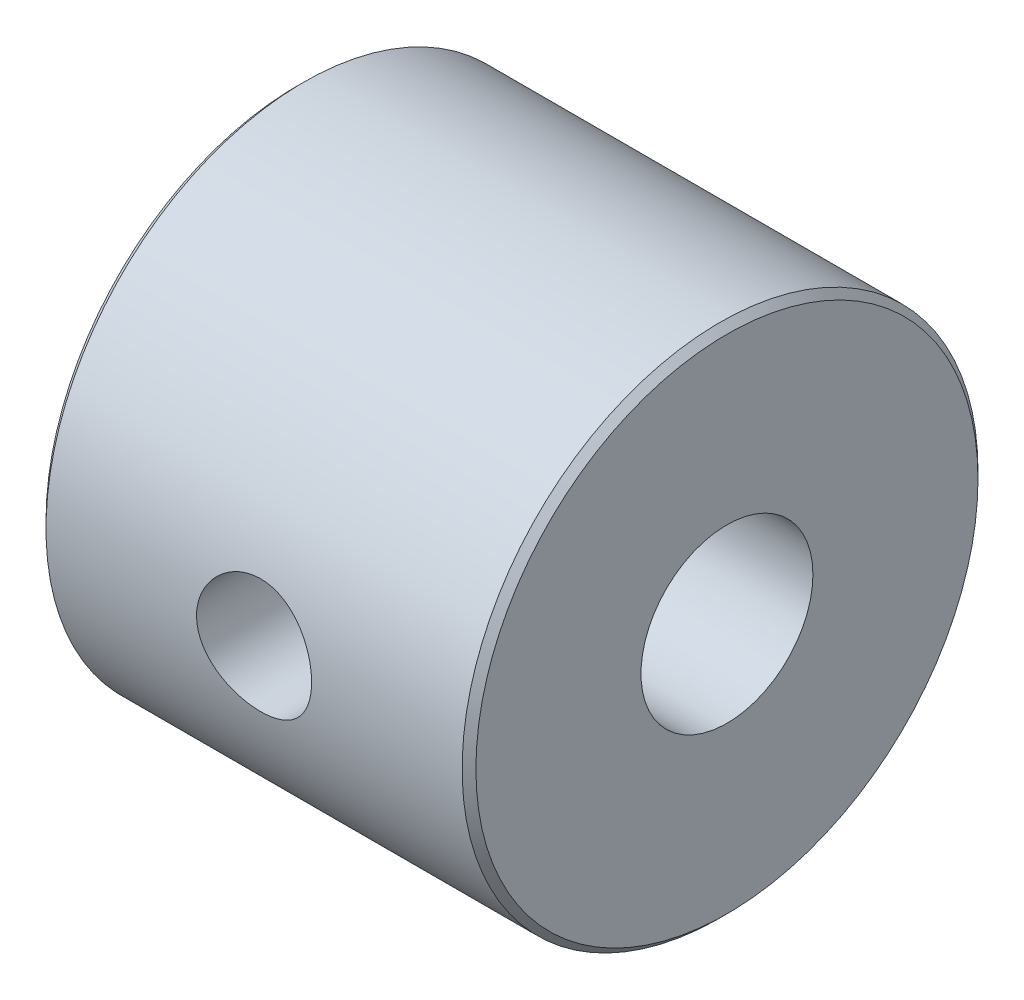
ISO-10303-21;
HEADER;
FILE_DESCRIPTION(('STEP AP214'),'2;1');
FILE_NAME('part.step','',(''),(''),'','','');
FILE_SCHEMA(('AUTOMOTIVE_DESIGN { 1 0 10303 214 1 1 1 1 }'));
ENDSEC;
DATA;
#1=APPLICATION_CONTEXT('core data for automotive mechanical design processes');
#2=APPLICATION_PROTOCOL_DEFINITION('international standard','automotive_design',2000,#1);
#3=PRODUCT_CONTEXT('',#1,'mechanical');
#4=PRODUCT('Part','Part','',(#3));
#5=PRODUCT_RELATED_PRODUCT_CATEGORY('part','',(#4));
#6=PRODUCT_DEFINITION_FORMATION('','',#4);
#7=PRODUCT_DEFINITION_CONTEXT('part definition',#1,'design');
#8=PRODUCT_DEFINITION('design','',#6,#7);
#9=PRODUCT_DEFINITION_SHAPE('','',#8);
#10=(LENGTH_UNIT() NAMED_UNIT(*) SI_UNIT(.MILLI.,.METRE.));
#11=(NAMED_UNIT(*) PLANE_ANGLE_UNIT() SI_UNIT($,.RADIAN.));
#12=(NAMED_UNIT(*) SI_UNIT($,.STERADIAN.) SOLID_ANGLE_UNIT());
#13=UNCERTAINTY_MEASURE_WITH_UNIT(LENGTH_MEASURE(1.E-05),#10,'distance_accuracy_value','');
#14=(GEOMETRIC_REPRESENTATION_CONTEXT(3) GLOBAL_UNCERTAINTY_ASSIGNED_CONTEXT((#13)) GLOBAL_UNIT_ASSIGNED_CONTEXT((#10,
#11,#12)) REPRESENTATION_CONTEXT('',''));
#15=CARTESIAN_POINT('',(0.,0.,0.));
#16=DIRECTION('',(0.,0.,1.));
#17=DIRECTION('',(1.,0.,0.));
#18=AXIS2_PLACEMENT_3D('',#15,#16,#17);
#19=CARTESIAN_POINT('',(31.75,0.,0.));
#20=DIRECTION('',(-1.,0.,0.));
#21=DIRECTION('',(0.,0.,1.));
#22=AXIS2_PLACEMENT_3D('',#19,#20,#21);
#23=CYLINDRICAL_SURFACE('',#22,19.05);
#24=CARTESIAN_POINT('',(31.242,0.,0.));
#25=DIRECTION('',(1.,0.,0.));
#26=DIRECTION('',(0.,0.,-1.));
#27=AXIS2_PLACEMENT_3D('',#24,#25,#26);
#28=CIRCLE('',#27,19.05);
#29=CARTESIAN_POINT('',(31.242,0.,-19.05));
#30=VERTEX_POINT('',#29);
#31=EDGE_CURVE('E38',#30,#30,#28,.F.);
#32=ORIENTED_EDGE('',*,*,#31,.T.);
#33=EDGE_LOOP('',(#32));
#34=FACE_BOUND('',#33,.T.);
#35=CARTESIAN_POINT('',(0.508000000000002,0.,0.));
#36=DIRECTION('',(1.,0.,0.));
#37=DIRECTION('',(0.,0.,-1.));
#38=AXIS2_PLACEMENT_3D('',#35,#36,#37);
#39=CIRCLE('',#38,19.05);
#40=CARTESIAN_POINT('',(0.508000000000002,0.,-19.05));
#41=VERTEX_POINT('',#40);
#42=EDGE_CURVE('E42',#41,#41,#39,.T.);
#43=ORIENTED_EDGE('',*,*,#42,.T.);
#44=EDGE_LOOP('',(#43));
#45=FACE_BOUND('',#44,.T.);
#46=CARTESIAN_POINT('',(18.375,0.,-19.05));
#47=CARTESIAN_POINT('',(18.3749940986378,0.139781689040155,-19.0499979719399));
#48=CARTESIAN_POINT('',(18.3632371077216,0.27964927887069,-19.0484452828352));
#49=CARTESIAN_POINT('',(18.316524062184,0.555488355699099,-19.0424006678495));
#50=CARTESIAN_POINT('',(18.28154416393,0.691455688353974,-19.037905721134));
#51=CARTESIAN_POINT('',(18.1894371364801,0.955461303983656,-19.0264826809257));
#52=CARTESIAN_POINT('',(18.1323253439302,1.08350500666245,-19.0195562726648));
#53=CARTESIAN_POINT('',(17.9976102237656,1.32816752955174,-19.0040395011631));
#54=CARTESIAN_POINT('',(17.9200102543922,1.44478821783099,-18.9954494106798));
#55=CARTESIAN_POINT('',(17.7460206019274,1.66402230818858,-18.9775054082484));
#56=CARTESIAN_POINT('',(17.6495317561643,1.76655670340078,-18.9681476236082));
#57=CARTESIAN_POINT('',(17.4407163859627,1.95402689989863,-18.9497539226443));
#58=CARTESIAN_POINT('',(17.3283890318649,2.03896177870326,-18.940718023213));
#59=CARTESIAN_POINT('',(17.090567473734,2.18911951571436,-18.9239532259491));
#60=CARTESIAN_POINT('',(16.9650257765547,2.25426775946921,-18.9162293226606));
#61=CARTESIAN_POINT('',(16.7046649038769,2.36252633293306,-18.9030146191876));
#62=CARTESIAN_POINT('',(16.5698461158078,2.4056375823169,-18.8975237258144));
#63=CARTESIAN_POINT('',(16.2955809026825,2.46835700397864,-18.8894340332593));
#64=CARTESIAN_POINT('',(16.1561655887991,2.48809906044446,-18.8868187655614));
#65=CARTESIAN_POINT('',(15.875978074941,2.50393408779853,-18.8847261471262));
#66=CARTESIAN_POINT('',(15.7352059352049,2.5000281037995,-18.8852486577162));
#67=CARTESIAN_POINT('',(15.4572367716533,2.4687877134451,-18.8893574882128));
#68=CARTESIAN_POINT('',(15.3200228040394,2.44160116305862,-18.8929244720583));
#69=CARTESIAN_POINT('',(15.0521214795487,2.36480223499386,-18.9026901731022));
#70=CARTESIAN_POINT('',(14.921434267291,2.31518936064043,-18.9088889485864));
#71=CARTESIAN_POINT('',(14.6698390600702,2.19478839281525,-18.9232415833332));
#72=CARTESIAN_POINT('',(14.548961980565,2.12393642687668,-18.9314013249336));
#73=CARTESIAN_POINT('',(14.3207571976609,1.96311414632755,-18.9487520224993));
#74=CARTESIAN_POINT('',(14.2134301773892,1.87314286842861,-18.9579430304119));
#75=CARTESIAN_POINT('',(14.014514222326,1.67581831246169,-18.9764065059943));
#76=CARTESIAN_POINT('',(13.9230515998653,1.56833766371212,-18.9856790601894));
#77=CARTESIAN_POINT('',(13.7594455055069,1.33948286070071,-19.0031953612218));
#78=CARTESIAN_POINT('',(13.6873020862709,1.21810866856812,-19.0114391052547));
#79=CARTESIAN_POINT('',(13.5643807098341,0.964811928950426,-19.0259748138382));
#80=CARTESIAN_POINT('',(13.5136110884205,0.832885289833144,-19.0322660166462));
#81=CARTESIAN_POINT('',(13.4349809541242,0.562278365918328,-19.0421810361741));
#82=CARTESIAN_POINT('',(13.4071192583521,0.423598430230412,-19.0458049906207));
#83=CARTESIAN_POINT('',(13.375260564846,0.144513215886066,-19.0499592130436));
#84=CARTESIAN_POINT('',(13.3710896477447,0.00412811338562915,-19.0505120263026));
#85=CARTESIAN_POINT('',(13.3862713139097,-0.275339161875183,-19.0485226670755));
#86=CARTESIAN_POINT('',(13.405623343743,-0.414421365211761,-19.0459805674045));
#87=CARTESIAN_POINT('',(13.4671570482528,-0.686818455369707,-19.0381010286319));
#88=CARTESIAN_POINT('',(13.5092553747015,-0.820152490765829,-19.0327737972571));
#89=CARTESIAN_POINT('',(13.6149997131701,-1.07786858605537,-19.0199201415042));
#90=CARTESIAN_POINT('',(13.6786465242341,-1.2022503137789,-19.0123936355758));
#91=CARTESIAN_POINT('',(13.826098941591,-1.43930501622495,-18.9959236924494));
#92=CARTESIAN_POINT('',(13.910016544571,-1.55190777736,-18.9869724808617));
#93=CARTESIAN_POINT('',(14.0954705801481,-1.76149279108896,-18.9686776477334));
#94=CARTESIAN_POINT('',(14.1970077865691,-1.85847435726501,-18.9593340089716));
#95=CARTESIAN_POINT('',(14.4155868153536,-2.03468478726578,-18.9412373912647));
#96=CARTESIAN_POINT('',(14.5327222165357,-2.11379805356646,-18.9324885008275));
#97=CARTESIAN_POINT('',(14.7787205531304,-2.25122641766461,-18.9166404374497));
#98=CARTESIAN_POINT('',(14.9075832333968,-2.30954196781502,-18.9095412286295));
#99=CARTESIAN_POINT('',(15.1730118077069,-2.40353423040343,-18.8978246235153));
#100=CARTESIAN_POINT('',(15.3095546581268,-2.43927510293925,-18.893200199343));
#101=CARTESIAN_POINT('',(15.5867688386097,-2.48730955867046,-18.8869369578119));
#102=CARTESIAN_POINT('',(15.7274399549183,-2.49960435369531,-18.8852979861478));
#103=CARTESIAN_POINT('',(16.0077670435217,-2.50037387693662,-18.8851960233401));
#104=CARTESIAN_POINT('',(16.1474225430022,-2.48903023874708,-18.8867088145816));
#105=CARTESIAN_POINT('',(16.4228231626314,-2.44323060009688,-18.8926877270721));
#106=CARTESIAN_POINT('',(16.5585682837408,-2.40877460531362,-18.8971538475957));
#107=CARTESIAN_POINT('',(16.822264729803,-2.31778690220757,-18.9085284809878));
#108=CARTESIAN_POINT('',(16.9502194440744,-2.26126487448977,-18.9154359226969));
#109=CARTESIAN_POINT('',(17.194857930642,-2.12776740713926,-18.930916552256));
#110=CARTESIAN_POINT('',(17.3115415048805,-2.05079160817995,-18.9394897693692));
#111=CARTESIAN_POINT('',(17.5312527928675,-1.8779008571677,-18.9574147956252));
#112=CARTESIAN_POINT('',(17.6341736833042,-1.78185068793612,-18.9667718706057));
#113=CARTESIAN_POINT('',(17.8225048291617,-1.57382128727449,-18.9851643854559));
#114=CARTESIAN_POINT('',(17.9079109659358,-1.46183831966128,-18.9941997492624));
#115=CARTESIAN_POINT('',(18.0590968227979,-1.22458043168706,-19.0109729834733));
#116=CARTESIAN_POINT('',(18.1247929045609,-1.09925184218548,-19.0187052652188));
#117=CARTESIAN_POINT('',(18.2341105288687,-0.839306696881373,-19.031945070151));
#118=CARTESIAN_POINT('',(18.2777557978644,-0.704700301956284,-19.0374549832904));
#119=CARTESIAN_POINT('',(18.331411488327,-0.474515037085983,-19.0443172737458));
#120=CARTESIAN_POINT('',(18.3477333478902,-0.380381125215548,-19.046437784803));
#121=CARTESIAN_POINT('',(18.3695295726849,-0.190844817719932,-19.0492798344051));
#122=CARTESIAN_POINT('',(18.3750040294288,-0.0954424328028588,-19.0500013847521));
#123=CARTESIAN_POINT('',(18.375,0.,-19.05));
#124=B_SPLINE_CURVE_WITH_KNOTS('',3,(#46,#47,#48,#49,#50,#51,#52,#53,#54,#55,#56,#57,#58,#59,
#60,#61,#62,#63,#64,#65,#66,#67,#68,#69,#70,#71,#72,#73,#74,#75,#76,#77,#78,#79,#80,#81,#82,#83,
#84,#85,#86,#87,#88,#89,#90,#91,#92,#93,#94,#95,#96,#97,#98,#99,#100,#101,#102,#103,#104,#105,
#106,#107,#108,#109,#110,#111,#112,#113,#114,#115,#116,#117,#118,#119,#120,#121,#122,#123),
.UNSPECIFIED.,.T.,.F.,(4,2,2,2,2,2,2,2,2,2,2,2,2,2,2,2,2,2,2,2,2,2,2,2,2,2,2,2,2,2,2,2,2,2,2,2,
2,2,4),(0.,0.418996415350858,0.838423693162188,1.25756084046036,1.6766293290993,
2.09795987791753,2.51931250525004,2.94223485027325,3.36513954394186,3.78560946846697,
4.20606081068031,4.62386148492033,5.04167141263338,5.46075064791518,5.87985100267621,
6.30214867085866,6.72444749015956,7.14691085388964,7.56935240163983,7.98868866189615,
8.40801505646649,8.82581525057175,9.2436309389142,9.6638101071185,10.0840077335685,
10.506850530028,10.9296841290426,11.3513105087945,11.7729150958553,12.1912920956066,
12.6096689925862,13.0278625490287,13.4460634526738,13.8673421919036,14.2887198827806,
14.7118611625296,15.134546171695,15.4206378255109,15.7067270657495),.UNSPECIFIED.);
#125=CARTESIAN_POINT('',(18.375,0.,-19.05));
#126=VERTEX_POINT('',#125);
#127=EDGE_CURVE('E59',#126,#126,#124,.T.);
#128=ORIENTED_EDGE('',*,*,#127,.T.);
#129=EDGE_LOOP('',(#128));
#130=FACE_BOUND('',#129,.T.);
#131=CARTESIAN_POINT('',(11.625,0.,19.05));
#132=CARTESIAN_POINT('',(11.6250078775895,-0.235596980444605,19.0499956748903));
#133=CARTESIAN_POINT('',(11.6446564461589,-0.471288134018262,19.045585154015));
#134=CARTESIAN_POINT('',(11.7226452362306,-0.935967708059661,19.0284168836046));
#135=CARTESIAN_POINT('',(11.7810123477362,-1.16495135468392,19.0156533329786));
#136=CARTESIAN_POINT('',(11.9345127671249,-1.60943387367071,18.9831991050863));
#137=CARTESIAN_POINT('',(12.0296068978138,-1.8249468317421,18.9635158112025));
#138=CARTESIAN_POINT('',(12.2537358032901,-2.23695281993615,18.9193427295638));
#139=CARTESIAN_POINT('',(12.3827699745116,-2.43344618820486,18.8948530272847));
#140=CARTESIAN_POINT('',(12.6733897559712,-2.8051141645124,18.843290734611));
#141=CARTESIAN_POINT('',(12.8354325867683,-2.97992669367173,18.8161850412217));
#142=CARTESIAN_POINT('',(13.1864886666675,-3.30013014320736,18.7626771842304));
#143=CARTESIAN_POINT('',(13.3755043960157,-3.44551835494517,18.7362750855916));
#144=CARTESIAN_POINT('',(13.7778356905257,-3.70435750986058,18.6868364741446));
#145=CARTESIAN_POINT('',(13.9914065760373,-3.81742040832303,18.6638423305168));
#146=CARTESIAN_POINT('',(14.4351151094985,-4.00590956669257,18.6242993257419));
#147=CARTESIAN_POINT('',(14.6652506863057,-4.08134052253393,18.6077496604716));
#148=CARTESIAN_POINT('',(15.1316207852718,-4.19122281806099,18.5833070008859));
#149=CARTESIAN_POINT('',(15.3676966856411,-4.22631658720661,18.5752784582765));
#150=CARTESIAN_POINT('',(15.842511296341,-4.25652636672152,18.5683801581588));
#151=CARTESIAN_POINT('',(16.0812496617453,-4.25164749687903,18.5695092277221));
#152=CARTESIAN_POINT('',(16.5498172398158,-4.20256689310267,18.5806759745756));
#153=CARTESIAN_POINT('',(16.7797295423077,-4.15911393953817,18.5905440068534));
#154=CARTESIAN_POINT('',(17.2289164374559,-4.03530601182196,18.6178083049889));
#155=CARTESIAN_POINT('',(17.4481904109233,-3.95494889255784,18.6352050084589));
#156=CARTESIAN_POINT('',(17.8719683372588,-3.75893277003606,18.6757321213875));
#157=CARTESIAN_POINT('',(18.0763355199346,-3.64298800812949,18.6989086478394));
#158=CARTESIAN_POINT('',(18.462989166743,-3.37928862058338,18.7483560180788));
#159=CARTESIAN_POINT('',(18.6452725005791,-3.23152949361027,18.7746272994968));
#160=CARTESIAN_POINT('',(18.9868925395679,-2.90444327246553,18.8280301736636));
#161=CARTESIAN_POINT('',(19.1456198827924,-2.72448007681627,18.8551678154862));
#162=CARTESIAN_POINT('',(19.4307427716325,-2.34017913287333,18.9067074968035));
#163=CARTESIAN_POINT('',(19.5571376847938,-2.1358409078947,18.9311094827808));
#164=CARTESIAN_POINT('',(19.7741678875936,-1.70783000207662,18.9745127111338));
#165=CARTESIAN_POINT('',(19.8647208123173,-1.48411421181882,18.9935014862761));
#166=CARTESIAN_POINT('',(20.0067780979173,-1.0241233082929,19.0238464561125));
#167=CARTESIAN_POINT('',(20.0582883716468,-0.787850102597398,19.0352038065257));
#168=CARTESIAN_POINT('',(20.1199060269274,-0.314675936425735,19.0488408918955));
#169=CARTESIAN_POINT('',(20.130845447751,-0.07788843618531,19.0513030250007));
#170=CARTESIAN_POINT('',(20.1132696175541,0.394130840678833,19.0473844949497));
#171=CARTESIAN_POINT('',(20.0847571564738,0.629362726129835,19.0410044570899));
#172=CARTESIAN_POINT('',(19.9897764190875,1.08881879719047,19.0202338073902));
#173=CARTESIAN_POINT('',(19.9237468721061,1.31313823927429,19.0059358369726));
#174=CARTESIAN_POINT('',(19.7560951341702,1.74751622632604,18.9709307301747));
#175=CARTESIAN_POINT('',(19.6544698280383,1.95757352121491,18.9502230328631));
#176=CARTESIAN_POINT('',(19.4167939142541,2.36088789885544,18.9042469958286));
#177=CARTESIAN_POINT('',(19.2802575123793,2.55385138211111,18.8789158753998));
#178=CARTESIAN_POINT('',(18.9772723243695,2.91442580798208,18.8266267490074));
#179=CARTESIAN_POINT('',(18.8108194854449,3.08203330994128,18.7996685229483));
#180=CARTESIAN_POINT('',(18.4489016392323,3.39044637005849,18.7465299239025));
#181=CARTESIAN_POINT('',(18.2529403665359,3.53067467250961,18.7203744711286));
#182=CARTESIAN_POINT('',(17.839761522143,3.77623577629903,18.6723930077702));
#183=CARTESIAN_POINT('',(17.6225448819204,3.8815701059095,18.6505668075918));
#184=CARTESIAN_POINT('',(17.1741958039019,4.05362826859852,18.6139287130227));
#185=CARTESIAN_POINT('',(16.9431512502322,4.12057219271947,18.5990769252978));
#186=CARTESIAN_POINT('',(16.4727168692664,4.21458727878124,18.5780009126678));
#187=CARTESIAN_POINT('',(16.2333284456482,4.24166511451448,18.5717752437154));
#188=CARTESIAN_POINT('',(15.758828575099,4.25488649348683,18.568749945406));
#189=CARTESIAN_POINT('',(15.5237435408445,4.24194616850769,18.5717393511823));
#190=CARTESIAN_POINT('',(15.0591949448321,4.17755306967668,18.5863288518167));
#191=CARTESIAN_POINT('',(14.8297313112493,4.12610078815942,18.5979288365975));
#192=CARTESIAN_POINT('',(14.3837023706338,3.98659494105887,18.6283276021893));
#193=CARTESIAN_POINT('',(14.1670917800101,3.89867982286733,18.6470991319999));
#194=CARTESIAN_POINT('',(13.7515605741334,3.68886096581474,18.6897355601408));
#195=CARTESIAN_POINT('',(13.5526418900234,3.56695352254511,18.7136010135291));
#196=CARTESIAN_POINT('',(13.1736364405692,3.28959403067173,18.7643626708187));
#197=CARTESIAN_POINT('',(12.9940328734151,3.13349130156564,18.7913119961706));
#198=CARTESIAN_POINT('',(12.6632700904681,2.79348455708471,18.8448535516644));
#199=CARTESIAN_POINT('',(12.5121174754925,2.60957410793037,18.8714456976124));
#200=CARTESIAN_POINT('',(12.2405713806368,2.21615353627842,18.9217065752127));
#201=CARTESIAN_POINT('',(12.1206247523042,2.00632893761288,18.9453305703215));
#202=CARTESIAN_POINT('',(11.9178933752718,1.56900985210211,18.9865419494512));
#203=CARTESIAN_POINT('',(11.8350780463722,1.34153008732898,19.0041342981307));
#204=CARTESIAN_POINT('',(11.7233991533403,0.928249621575709,19.0282311419841));
#205=CARTESIAN_POINT('',(11.6865710603558,0.744653044900812,19.0363431931296));
#206=CARTESIAN_POINT('',(11.6373689406188,0.374057325654092,19.04722921162));
#207=CARTESIAN_POINT('',(11.624993745383,0.187058346097254,19.0500034340333));
#208=CARTESIAN_POINT('',(11.625,0.,19.05));
#209=B_SPLINE_CURVE_WITH_KNOTS('',3,(#131,#132,#133,#134,#135,#136,#137,#138,#139,#140,#141,
#142,#143,#144,#145,#146,#147,#148,#149,#150,#151,#152,#153,#154,#155,#156,#157,#158,#159,#160,
#161,#162,#163,#164,#165,#166,#167,#168,#169,#170,#171,#172,#173,#174,#175,#176,#177,#178,#179,
#180,#181,#182,#183,#184,#185,#186,#187,#188,#189,#190,#191,#192,#193,#194,#195,#196,#197,#198,
#199,#200,#201,#202,#203,#204,#205,#206,#207,#208),.UNSPECIFIED.,.T.,.F.,(4,2,2,2,2,2,2,2,2,2,2,
2,2,2,2,2,2,2,2,2,2,2,2,2,2,2,2,2,2,2,2,2,2,2,2,2,2,2,4),(0.,0.706106131412663,1.4127031672095,
2.11854853921231,2.82438135980452,3.54075201658181,4.25718858847996,4.98189541757167,
5.70651179086563,6.41942029393282,7.13223748745485,7.83151323493795,8.53082963406458,
9.23591513439775,9.94110046111684,10.6621701551424,11.3832539529231,12.1059853128531,
12.8286071961301,13.5363246975007,14.2439921533857,14.9435495368666,15.6431681576994,
16.3531090668274,17.0631462244787,17.7868347114266,18.5104914983663,19.2299570059965,
19.9493020576247,20.6523021005479,21.3552931565128,22.0556390816513,22.7560613587923,
23.4711926262909,24.1864896052251,24.9115263171463,25.6359648092902,26.1966229166736,
26.7572542323293),.UNSPECIFIED.);
#210=CARTESIAN_POINT('',(11.625,0.,19.05));
#211=VERTEX_POINT('',#210);
#212=EDGE_CURVE('E82',#211,#211,#209,.T.);
#213=ORIENTED_EDGE('',*,*,#212,.F.);
#214=EDGE_LOOP('',(#213));
#215=FACE_BOUND('',#214,.T.);
#216=ADVANCED_FACE('F31',(#34,#45,#130,#215),#23,.T.);
#217=CARTESIAN_POINT('',(31.75,0.,0.));
#218=DIRECTION('',(-1.,0.,0.));
#219=DIRECTION('',(0.,0.,1.));
#220=AXIS2_PLACEMENT_3D('',#217,#218,#219);
#221=CYLINDRICAL_SURFACE('',#220,6.35);
#222=CARTESIAN_POINT('',(18.375,0.,-6.35));
#223=CARTESIAN_POINT('',(18.3749950049564,0.134553966169355,-6.34999617459859));
#224=CARTESIAN_POINT('',(18.3640751557637,0.269336571174968,-6.34567466237185));
#225=CARTESIAN_POINT('',(18.3207905952238,0.535088905639055,-6.32882335712604));
#226=CARTESIAN_POINT('',(18.2883711213123,0.66604800444862,-6.3162726039992));
#227=CARTESIAN_POINT('',(18.203434670697,0.919914813168561,-6.28431159303747));
#228=CARTESIAN_POINT('',(18.1509811437113,1.04284652175185,-6.26492300596665));
#229=CARTESIAN_POINT('',(18.0277180152143,1.27806359095826,-6.22120434546761));
#230=CARTESIAN_POINT('',(17.9569140186473,1.39035218812232,-6.19687578139019));
#231=CARTESIAN_POINT('',(17.795524683543,1.60639851936583,-6.14449798213655));
#232=CARTESIAN_POINT('',(17.7042361026491,1.70960334693637,-6.11633571933088));
#233=CARTESIAN_POINT('',(17.5059538296745,1.89970207687357,-6.05999026085159));
#234=CARTESIAN_POINT('',(17.3989529399151,1.98658846210173,-6.03180706150566));
#235=CARTESIAN_POINT('',(17.1667151987723,2.14524488686994,-5.97727145355802));
#236=CARTESIAN_POINT('',(17.0408937121066,2.2162084253797,-5.95104909754738));
#237=CARTESIAN_POINT('',(16.777911943275,2.33571898850402,-5.90517107596173));
#238=CARTESIAN_POINT('',(16.6407568739592,2.38427625190023,-5.88551241217646));
#239=CARTESIAN_POINT('',(16.3653508494304,2.45537613995342,-5.8561981222935));
#240=CARTESIAN_POINT('',(16.2274172333414,2.47897530665883,-5.84613817491155));
#241=CARTESIAN_POINT('',(15.949209226471,2.50279043279639,-5.83598535211524));
#242=CARTESIAN_POINT('',(15.8089359703588,2.50301741528153,-5.83588777813421));
#243=CARTESIAN_POINT('',(15.5400547077634,2.48088430587097,-5.84532483029983));
#244=CARTESIAN_POINT('',(15.4112951322367,2.46003752778908,-5.85421411113578));
#245=CARTESIAN_POINT('',(15.1592758587167,2.39886638306082,-5.87954286720676));
#246=CARTESIAN_POINT('',(15.0360170916798,2.35853873302629,-5.89598361517486));
#247=CARTESIAN_POINT('',(14.7955810024347,2.25879178559437,-5.93491910985821));
#248=CARTESIAN_POINT('',(14.6785751860298,2.19900587681632,-5.95752864103769));
#249=CARTESIAN_POINT('',(14.4558363361866,2.0622963800787,-6.00622089947436));
#250=CARTESIAN_POINT('',(14.3501074730521,1.9853664844086,-6.03230490365427));
#251=CARTESIAN_POINT('',(14.1446155241556,1.80979694623541,-6.0873805687355));
#252=CARTESIAN_POINT('',(14.0458875988427,1.70996507725302,-6.11644390139133));
#253=CARTESIAN_POINT('',(13.8662495741734,1.49484520138701,-6.17254267496692));
#254=CARTESIAN_POINT('',(13.7853428057571,1.3795543115359,-6.19957773616227));
#255=CARTESIAN_POINT('',(13.64234229979,1.13392939532751,-6.24921353521059));
#256=CARTESIAN_POINT('',(13.5806264607627,1.00335545974232,-6.27172244517836));
#257=CARTESIAN_POINT('',(13.4803899460577,0.732568757301266,-6.30907908571734));
#258=CARTESIAN_POINT('',(13.4418578689403,0.592360766197814,-6.32393058157942));
#259=CARTESIAN_POINT('',(13.3911494695432,0.314971963627265,-6.34361908161966));
#260=CARTESIAN_POINT('',(13.37758130377,0.178082917418505,-6.348984250052));
#261=CARTESIAN_POINT('',(13.3730907416084,-0.0961072640949436,-6.35075118028059));
#262=CARTESIAN_POINT('',(13.382162700082,-0.233408288149805,-6.34715517647539));
#263=CARTESIAN_POINT('',(13.4216622025234,-0.498292224086756,-6.33175038685379));
#264=CARTESIAN_POINT('',(13.4511495639312,-0.626038654697896,-6.32030337018418));
#265=CARTESIAN_POINT('',(13.5293742319494,-0.874660095981651,-6.29071971537707));
#266=CARTESIAN_POINT('',(13.5781140222739,-0.995534217770083,-6.2725822141346));
#267=CARTESIAN_POINT('',(13.6950444521159,-1.23110128938448,-6.23070166506756));
#268=CARTESIAN_POINT('',(13.7637803030612,-1.34549548641504,-6.20680525763775));
#269=CARTESIAN_POINT('',(13.9181441471455,-1.56152383451872,-6.15601152025899));
#270=CARTESIAN_POINT('',(14.003778787948,-1.66315293821617,-6.12911301115501));
#271=CARTESIAN_POINT('',(14.1959406850939,-1.85758269622987,-6.07311877997172));
#272=CARTESIAN_POINT('',(14.3034541282674,-1.9494024550278,-6.04399258985355));
#273=CARTESIAN_POINT('',(14.532894500357,-2.1139256988637,-5.98843710342074));
#274=CARTESIAN_POINT('',(14.6548234956553,-2.18662643847838,-5.9620081947592));
#275=CARTESIAN_POINT('',(14.9112445072933,-2.31119994331425,-5.91484149302209));
#276=CARTESIAN_POINT('',(15.0458308081313,-2.3628981425998,-5.89415183494788));
#277=CARTESIAN_POINT('',(15.3228548094581,-2.44251241444137,-5.86161395579081));
#278=CARTESIAN_POINT('',(15.4652868886552,-2.4704452841983,-5.84975949077937));
#279=CARTESIAN_POINT('',(15.743211889923,-2.5001560817428,-5.83711880455703));
#280=CARTESIAN_POINT('',(15.8784922692523,-2.50362861133498,-5.83561562798868));
#281=CARTESIAN_POINT('',(16.1476084404769,-2.48874240848286,-5.84197965531299));
#282=CARTESIAN_POINT('',(16.2814444006197,-2.47038624697604,-5.84984575571204));
#283=CARTESIAN_POINT('',(16.5387958562813,-2.4137318242914,-5.87343850874575));
#284=CARTESIAN_POINT('',(16.6625100297439,-2.37619878243832,-5.88886266755422));
#285=CARTESIAN_POINT('',(16.9019403587713,-2.28296099085997,-5.92562971284347));
#286=CARTESIAN_POINT('',(17.017654393116,-2.22725144389621,-5.94697416161505));
#287=CARTESIAN_POINT('',(17.2448650669459,-2.09562924514573,-5.99466372804074));
#288=CARTESIAN_POINT('',(17.3557615112271,-2.01875899704479,-6.02122212029708));
#289=CARTESIAN_POINT('',(17.5636202572178,-1.84841299459082,-6.07567751475916));
#290=CARTESIAN_POINT('',(17.6605776715191,-1.75493144142048,-6.10357498193042));
#291=CARTESIAN_POINT('',(17.8439681894365,-1.5471064695902,-6.15964587366995));
#292=CARTESIAN_POINT('',(17.9293735925985,-1.43182793668255,-6.1877288181631));
#293=CARTESIAN_POINT('',(18.0796111272694,-1.18753251019108,-6.23921573147771));
#294=CARTESIAN_POINT('',(18.144440520185,-1.05851379088707,-6.26261907730808));
#295=CARTESIAN_POINT('',(18.2466484853223,-0.801712000574561,-6.30040957078148));
#296=CARTESIAN_POINT('',(18.2858921084602,-0.674756215325959,-6.31539404397001));
#297=CARTESIAN_POINT('',(18.3437302524382,-0.415787686623074,-6.3376970595587));
#298=CARTESIAN_POINT('',(18.3623815268315,-0.283789884654928,-6.3450366684114));
#299=CARTESIAN_POINT('',(18.3719467777404,-0.126085882756387,-6.34879873710875));
#300=CARTESIAN_POINT('',(18.3730908694645,-0.100887023550413,-6.34924857226754));
#301=CARTESIAN_POINT('',(18.374617969314,-0.0504614577838966,-6.34984957040439));
#302=CARTESIAN_POINT('',(18.375000936789,-0.0252347498079839,-6.35000071742997));
#303=CARTESIAN_POINT('',(18.375,0.,-6.35));
#304=B_SPLINE_CURVE_WITH_KNOTS('',3,(#222,#223,#224,#225,#226,#227,#228,#229,#230,#231,#232,
#233,#234,#235,#236,#237,#238,#239,#240,#241,#242,#243,#244,#245,#246,#247,#248,#249,#250,#251,
#252,#253,#254,#255,#256,#257,#258,#259,#260,#261,#262,#263,#264,#265,#266,#267,#268,#269,#270,
#271,#272,#273,#274,#275,#276,#277,#278,#279,#280,#281,#282,#283,#284,#285,#286,#287,#288,#289,
#290,#291,#292,#293,#294,#295,#296,#297,#298,#299,#300,#301,#302,#303),.UNSPECIFIED.,.T.,.F.,(4,
2,2,2,2,2,2,2,2,2,2,2,2,2,2,2,2,2,2,2,2,2,2,2,2,2,2,2,2,2,2,2,2,2,2,2,2,2,2,2,4),(0.,
0.403558875489098,0.808149640616257,1.21146951410153,1.61466634295684,2.03471952872487,
2.45496574116262,2.89320518926667,3.33124418047491,3.74989041671428,4.16833920539152,
4.55873339731187,4.94919341088217,5.34748294469489,5.7459192620459,6.17411035489119,
6.60238141285147,7.0386180307487,7.47463993804278,7.88551530365009,8.29628823093428,
8.68930295059461,9.08236838880241,9.48735796439885,9.8925071739458,10.3235785470974,
10.7547117868103,11.1893585465848,11.623697844666,12.027621150145,12.4314968870954,
12.8203869038963,13.2093796417258,13.620181819931,14.0311276872341,14.4675975397313,
14.9041254604669,15.3035452259819,15.701861401018,15.7775422872301,15.853227215335),.UNSPECIFIED.);
#305=CARTESIAN_POINT('',(18.375,0.,-6.35));
#306=VERTEX_POINT('',#305);
#307=EDGE_CURVE('E52',#306,#306,#304,.T.);
#308=ORIENTED_EDGE('',*,*,#307,.F.);
#309=EDGE_LOOP('',(#308));
#310=FACE_BOUND('',#309,.T.);
#311=CARTESIAN_POINT('',(0.,0.,0.));
#312=DIRECTION('',(1.,0.,0.));
#313=DIRECTION('',(0.,0.,-1.));
#314=AXIS2_PLACEMENT_3D('',#311,#312,#313);
#315=CIRCLE('',#314,6.35);
#316=CARTESIAN_POINT('',(0.,0.,-6.35));
#317=VERTEX_POINT('',#316);
#318=EDGE_CURVE('E106',#317,#317,#315,.T.);
#319=ORIENTED_EDGE('',*,*,#318,.F.);
#320=EDGE_LOOP('',(#319));
#321=FACE_BOUND('',#320,.T.);
#322=CARTESIAN_POINT('',(31.75,0.,0.));
#323=DIRECTION('',(1.,0.,0.));
#324=DIRECTION('',(0.,0.,-1.));
#325=AXIS2_PLACEMENT_3D('',#322,#323,#324);
#326=CIRCLE('',#325,6.35);
#327=CARTESIAN_POINT('',(31.75,0.,-6.35));
#328=VERTEX_POINT('',#327);
#329=EDGE_CURVE('E51',#328,#328,#326,.T.);
#330=ORIENTED_EDGE('',*,*,#329,.T.);
#331=EDGE_LOOP('',(#330));
#332=FACE_BOUND('',#331,.T.);
#333=CARTESIAN_POINT('',(20.125,0.,6.35));
#334=CARTESIAN_POINT('',(20.1250000427101,0.106663462632682,6.35000004539256));
#335=CARTESIAN_POINT('',(20.1209790697073,0.213325881475982,6.34730669861905));
#336=CARTESIAN_POINT('',(20.1049571198466,0.425818635656144,6.33660020303112));
#337=CARTESIAN_POINT('',(20.0929530473953,0.531648632092113,6.32858499056743));
#338=CARTESIAN_POINT('',(20.0611429112683,0.741603551278382,6.30742818163162));
#339=CARTESIAN_POINT('',(20.0413373198844,0.845728576847548,6.29428689548436));
#340=CARTESIAN_POINT('',(19.9942130905437,1.05154694690419,6.26319476322004));
#341=CARTESIAN_POINT('',(19.9668912530932,1.15323923574859,6.24524186899564));
#342=CARTESIAN_POINT('',(19.8744759466453,1.45260605115246,6.18494897968906));
#343=CARTESIAN_POINT('',(19.7987410588871,1.64580002797676,6.13604386041241));
#344=CARTESIAN_POINT('',(19.622142344913,2.01583182722331,6.02464905566807));
#345=CARTESIAN_POINT('',(19.5212747619491,2.19266719899448,5.96215733950123));
#346=CARTESIAN_POINT('',(19.287923229114,2.54209973370208,5.82224821550171));
#347=CARTESIAN_POINT('',(19.1534785127023,2.71305392241933,5.74401298986289));
#348=CARTESIAN_POINT('',(18.861431410679,3.03158739457785,5.58246467299002));
#349=CARTESIAN_POINT('',(18.703795685573,3.17913237932083,5.49914437406296));
#350=CARTESIAN_POINT('',(18.4383118005877,3.39227521733549,5.36874326911306));
#351=CARTESIAN_POINT('',(18.3373561203395,3.46626580303488,5.32113807171357));
#352=CARTESIAN_POINT('',(18.1287029002193,3.60542333941211,5.2278530022502));
#353=CARTESIAN_POINT('',(18.021003820441,3.67058826385821,5.1821735739646));
#354=CARTESIAN_POINT('',(17.6884537151618,3.85193934489228,5.05047227613512));
#355=CARTESIAN_POINT('',(17.4536136155681,3.95441531620215,4.96950864734771));
#356=CARTESIAN_POINT('',(17.0336542836621,4.09313124224461,4.85535025852366));
#357=CARTESIAN_POINT('',(16.8539144680124,4.13996518148155,4.81511114028885));
#358=CARTESIAN_POINT('',(16.4867528453758,4.20987182032324,4.75412194707822));
#359=CARTESIAN_POINT('',(16.2993450352068,4.23298596684503,4.73333788280472));
#360=CARTESIAN_POINT('',(15.921140151073,4.25398311284153,4.71448494486316));
#361=CARTESIAN_POINT('',(15.7303321805042,4.25176018721054,4.71651143340077));
#362=CARTESIAN_POINT('',(15.3522391134377,4.22199571023032,4.74316408496659));
#363=CARTESIAN_POINT('',(15.1649571399309,4.19443270092747,4.76780940156197));
#364=CARTESIAN_POINT('',(14.8074968498533,4.11763061318343,4.83425369253599));
#365=CARTESIAN_POINT('',(14.636928032457,4.06943908303621,4.87521776502949));
#366=CARTESIAN_POINT('',(14.3061772179,3.95373621649045,4.96950966155582));
#367=CARTESIAN_POINT('',(14.1459986670865,3.88621850958065,5.02284156130846));
#368=CARTESIAN_POINT('',(13.8057188511111,3.71801014421801,5.14898583360738));
#369=CARTESIAN_POINT('',(13.6282307954693,3.61336060786915,5.22355218488158));
#370=CARTESIAN_POINT('',(13.2912648253418,3.38065308755118,5.37709744366563));
#371=CARTESIAN_POINT('',(13.1318095667108,3.25256617481629,5.45608171963362));
#372=CARTESIAN_POINT('',(12.7995927633904,2.94387782043362,5.62973294892286));
#373=CARTESIAN_POINT('',(12.6315659396761,2.75791894728697,5.72404585433874));
#374=CARTESIAN_POINT('',(12.3287600383482,2.35582008534264,5.90091320869186));
#375=CARTESIAN_POINT('',(12.1939504151171,2.13970811315303,5.98347843072157));
#376=CARTESIAN_POINT('',(11.9857946651095,1.72601321705397,6.11397737697846));
#377=CARTESIAN_POINT('',(11.9055854381107,1.53306353347,6.16552574627689));
#378=CARTESIAN_POINT('',(11.8067105869517,1.23393218913514,6.22979687089591));
#379=CARTESIAN_POINT('',(11.7773228308529,1.13258893017696,6.24904713854333));
#380=CARTESIAN_POINT('',(11.726041412153,0.927265119269704,6.28279236380054));
#381=CARTESIAN_POINT('',(11.7041447253863,0.823285649818614,6.29728924026909));
#382=CARTESIAN_POINT('',(11.6680636933641,0.612892794589259,6.3212444218768));
#383=CARTESIAN_POINT('',(11.653917643808,0.506469982830315,6.33067770335297));
#384=CARTESIAN_POINT('',(11.6337215551311,0.29256047738086,6.34416155904908));
#385=CARTESIAN_POINT('',(11.6276681618269,0.185074243070463,6.34821436332405));
#386=CARTESIAN_POINT('',(11.6237441518864,-0.0301312246428598,6.35084043070247));
#387=CARTESIAN_POINT('',(11.625874801025,-0.137850491512378,6.34941284618843));
#388=CARTESIAN_POINT('',(11.6382865762112,-0.352601206788481,6.34111342861899));
#389=CARTESIAN_POINT('',(11.6485673387971,-0.459632685653036,6.33424183834409));
#390=CARTESIAN_POINT('',(11.6760848031533,-0.664455312355957,6.31591570767091));
#391=CARTESIAN_POINT('',(11.6927644737899,-0.762354773453151,6.30482868285691));
#392=CARTESIAN_POINT('',(11.732780288761,-0.956204218665943,6.27835672478814));
#393=CARTESIAN_POINT('',(11.7561186852867,-1.05215353139728,6.2629703373897));
#394=CARTESIAN_POINT('',(11.8357181609976,-1.33614048439891,6.21080986958256));
#395=CARTESIAN_POINT('',(11.901586679826,-1.52048536820467,6.16801868328955));
#396=CARTESIAN_POINT('',(12.0608084374538,-1.88588375029244,6.06663610741601));
#397=CARTESIAN_POINT('',(12.1555543235027,-2.0661009239481,6.00726127812026));
#398=CARTESIAN_POINT('',(12.3676691764243,-2.40868414927565,5.87828871265739));
#399=CARTESIAN_POINT('',(12.4850517380393,-2.57103938124657,5.80868483931538));
#400=CARTESIAN_POINT('',(12.7600510249251,-2.9004608225688,5.65226609096892));
#401=CARTESIAN_POINT('',(12.9210956880043,-3.06419904589063,5.56447145780922));
#402=CARTESIAN_POINT('',(13.2673884556173,-3.36382875706528,5.38863123374627));
#403=CARTESIAN_POINT('',(13.452654161532,-3.49969980764485,5.30058550633394));
#404=CARTESIAN_POINT('',(13.8300939393365,-3.73175829326563,5.13953643620767));
#405=CARTESIAN_POINT('',(14.0205896706147,-3.83022074994705,5.06589501872926));
#406=CARTESIAN_POINT('',(14.4187619570164,-3.99854722211938,4.93412457395826));
#407=CARTESIAN_POINT('',(14.6264068474848,-4.0684625885743,4.87596775888733));
#408=CARTESIAN_POINT('',(15.0155912918958,-4.16609877474135,4.79264906177947));
#409=CARTESIAN_POINT('',(15.1948727918867,-4.19922656350859,4.7633778719238));
#410=CARTESIAN_POINT('',(15.5582763375006,-4.24211743665072,4.72523168655778));
#411=CARTESIAN_POINT('',(15.7423926398113,-4.25190707866634,4.71633350803932));
#412=CARTESIAN_POINT('',(16.1102361222553,-4.24747333225607,4.72032546743952));
#413=CARTESIAN_POINT('',(16.2939628592709,-4.23323023829508,4.73323348526242));
#414=CARTESIAN_POINT('',(16.6557139910157,-4.1816836469015,4.77882329332473));
#415=CARTESIAN_POINT('',(16.8337304219083,-4.14434930086916,4.81153153429245));
#416=CARTESIAN_POINT('',(17.2255908718636,-4.0360697729692,4.90294174121269));
#417=CARTESIAN_POINT('',(17.4366238690596,-3.95888669986636,4.96620545311481));
#418=CARTESIAN_POINT('',(17.8400425764271,-3.77497548019868,5.10739249579016));
#419=CARTESIAN_POINT('',(18.0324014750299,-3.66820567713517,5.18533644560506));
#420=CARTESIAN_POINT('',(18.4001167477307,-3.42573818181708,5.34870214016754));
#421=CARTESIAN_POINT('',(18.575090876166,-3.28953993699588,5.43423590216333));
#422=CARTESIAN_POINT('',(18.9022864563284,-2.99115658971889,5.60400902709952));
#423=CARTESIAN_POINT('',(19.0545007977133,-2.82896339888202,5.68824797818696));
#424=CARTESIAN_POINT('',(19.2741004171056,-2.55443250538021,5.81460373124655));
#425=CARTESIAN_POINT('',(19.3500889520754,-2.45011408378217,5.85943632819875));
#426=CARTESIAN_POINT('',(19.4928730631134,-2.2338895309982,5.94522843435642));
#427=CARTESIAN_POINT('',(19.5596727283863,-2.1219868082674,5.9861896638307));
#428=CARTESIAN_POINT('',(19.6832547823582,-1.89124596942599,6.06304112800329));
#429=CARTESIAN_POINT('',(19.740045419988,-1.77241367284349,6.09893553361628));
#430=CARTESIAN_POINT('',(19.8428137917653,-1.52854324582043,6.16457470744704));
#431=CARTESIAN_POINT('',(19.8887950729674,-1.40350716748688,6.19432149259761));
#432=CARTESIAN_POINT('',(19.9609964459007,-1.17410886525535,6.24137643638005));
#433=CARTESIAN_POINT('',(19.9893321341798,-1.07067392022611,6.25998342978081));
#434=CARTESIAN_POINT('',(20.0382136578145,-0.86122557607372,6.29221814361507));
#435=CARTESIAN_POINT('',(20.0587609949895,-0.755212678254226,6.30584682399281));
#436=CARTESIAN_POINT('',(20.0917531289022,-0.541460936253718,6.32778438600725));
#437=CARTESIAN_POINT('',(20.1042034068368,-0.43372331032985,6.33609686631161));
#438=CARTESIAN_POINT('',(20.1208268665557,-0.217323435350652,6.34720468079825));
#439=CARTESIAN_POINT('',(20.1249999564899,-0.108661176048302,6.34999995375727));
#440=CARTESIAN_POINT('',(20.125,0.,6.35));
#441=B_SPLINE_CURVE_WITH_KNOTS('',3,(#333,#334,#335,#336,#337,#338,#339,#340,#341,#342,#343,
#344,#345,#346,#347,#348,#349,#350,#351,#352,#353,#354,#355,#356,#357,#358,#359,#360,#361,#362,
#363,#364,#365,#366,#367,#368,#369,#370,#371,#372,#373,#374,#375,#376,#377,#378,#379,#380,#381,
#382,#383,#384,#385,#386,#387,#388,#389,#390,#391,#392,#393,#394,#395,#396,#397,#398,#399,#400,
#401,#402,#403,#404,#405,#406,#407,#408,#409,#410,#411,#412,#413,#414,#415,#416,#417,#418,#419,
#420,#421,#422,#423,#424,#425,#426,#427,#428,#429,#430,#431,#432,#433,#434,#435,#436,#437,#438,
#439,#440),.UNSPECIFIED.,.T.,.F.,(4,2,2,2,2,2,2,2,2,2,2,2,2,2,2,2,2,2,2,2,2,2,2,2,2,2,2,2,2,2,2,
2,2,2,2,2,2,2,2,2,2,2,2,2,2,2,2,2,2,2,2,2,2,4),(0.,0.319879222972718,0.639882557372199,
0.959866522252648,1.27998690830869,1.91652245728362,2.55315321051873,3.24399199558934,
3.93583381816178,4.33713293187168,4.73852402187401,5.53910222364585,6.10706525577737,
6.6740341557996,7.24337421347944,7.81319683217512,8.35699299751479,8.90096862188302,
9.55605228508618,10.2119500405263,11.0115029074528,11.810317760508,12.4530149869361,
12.7744544621422,13.0957640177844,13.4186471587548,13.7413964320075,14.0641956248845,
14.3869804230418,14.6864134976333,14.9859479702445,15.584511234023,16.2183999665659,
16.8526705812862,17.5874180932505,18.3227025438249,19.0003820533335,19.6768371138979,
20.2284031724244,20.7793412762043,21.3307313387879,21.8828596230012,22.5794347121997,
23.2769955681533,23.9875151785307,24.6982562992959,25.1076467110548,25.5168543435521,
25.9257231346778,26.3344575689985,26.6606081285335,26.9866957647799,27.3125624299261,
27.6384327111238),.UNSPECIFIED.);
#442=CARTESIAN_POINT('',(20.125,0.,6.35));
#443=VERTEX_POINT('',#442);
#444=EDGE_CURVE('E60',#443,#443,#441,.T.);
#445=ORIENTED_EDGE('',*,*,#444,.T.);
#446=EDGE_LOOP('',(#445));
#447=FACE_BOUND('',#446,.T.);
#448=ADVANCED_FACE('F65',(#310,#321,#332,#447),#221,.F.);
#449=CARTESIAN_POINT('',(31.75,0.,0.));
#450=DIRECTION('',(1.,0.,0.));
#451=DIRECTION('',(0.,0.,-1.));
#452=AXIS2_PLACEMENT_3D('',#449,#450,#451);
#453=PLANE('',#452);
#454=CARTESIAN_POINT('',(31.75,0.,0.));
#455=DIRECTION('',(1.,0.,0.));
#456=DIRECTION('',(0.,0.,-1.));
#457=AXIS2_PLACEMENT_3D('',#454,#455,#456);
#458=CIRCLE('',#457,18.542);
#459=CARTESIAN_POINT('',(31.75,0.,-18.542));
#460=VERTEX_POINT('',#459);
#461=EDGE_CURVE('E46',#460,#460,#458,.T.);
#462=ORIENTED_EDGE('',*,*,#461,.T.);
#463=EDGE_LOOP('',(#462));
#464=FACE_BOUND('',#463,.T.);
#465=ORIENTED_EDGE('',*,*,#329,.F.);
#466=EDGE_LOOP('',(#465));
#467=FACE_BOUND('',#466,.T.);
#468=ADVANCED_FACE('F100',(#464,#467),#453,.T.);
#469=CARTESIAN_POINT('',(0.,0.,0.));
#470=DIRECTION('',(1.,0.,0.));
#471=DIRECTION('',(0.,0.,-1.));
#472=AXIS2_PLACEMENT_3D('',#469,#470,#471);
#473=PLANE('',#472);
#474=CARTESIAN_POINT('',(0.,0.,0.));
#475=DIRECTION('',(1.,0.,0.));
#476=DIRECTION('',(0.,0.,-1.));
#477=AXIS2_PLACEMENT_3D('',#474,#475,#476);
#478=CIRCLE('',#477,18.542);
#479=CARTESIAN_POINT('',(0.,0.,-18.542));
#480=VERTEX_POINT('',#479);
#481=EDGE_CURVE('E10',#480,#480,#478,.F.);
#482=ORIENTED_EDGE('',*,*,#481,.T.);
#483=EDGE_LOOP('',(#482));
#484=FACE_BOUND('',#483,.T.);
#485=ORIENTED_EDGE('',*,*,#318,.T.);
#486=EDGE_LOOP('',(#485));
#487=FACE_BOUND('',#486,.T.);
#488=ADVANCED_FACE('F89',(#484,#487),#473,.F.);
#489=CARTESIAN_POINT('',(15.875,0.,19.05));
#490=DIRECTION('',(0.,0.,-1.));
#491=DIRECTION('',(-1.,0.,0.));
#492=AXIS2_PLACEMENT_3D('',#489,#490,#491);
#493=CYLINDRICAL_SURFACE('',#492,4.25);
#494=ORIENTED_EDGE('',*,*,#444,.F.);
#495=EDGE_LOOP('',(#494));
#496=FACE_BOUND('',#495,.T.);
#497=ORIENTED_EDGE('',*,*,#212,.T.);
#498=EDGE_LOOP('',(#497));
#499=FACE_BOUND('',#498,.T.);
#500=ADVANCED_FACE('F72',(#496,#499),#493,.F.);
#501=CARTESIAN_POINT('',(15.875,0.,-19.05));
#502=DIRECTION('',(0.,0.,1.));
#503=DIRECTION('',(1.,0.,0.));
#504=AXIS2_PLACEMENT_3D('',#501,#502,#503);
#505=CYLINDRICAL_SURFACE('',#504,2.5);
#506=ORIENTED_EDGE('',*,*,#307,.T.);
#507=EDGE_LOOP('',(#506));
#508=FACE_BOUND('',#507,.T.);
#509=ORIENTED_EDGE('',*,*,#127,.F.);
#510=EDGE_LOOP('',(#509));
#511=FACE_BOUND('',#510,.T.);
#512=ADVANCED_FACE('F68',(#508,#511),#505,.F.);
#513=CARTESIAN_POINT('',(31.75,0.,0.));
#514=DIRECTION('',(-1.,0.,0.));
#515=DIRECTION('',(0.,0.,1.));
#516=AXIS2_PLACEMENT_3D('',#513,#514,#515);
#517=CONICAL_SURFACE('',#516,18.542,0.785398163397435);
#518=ORIENTED_EDGE('',*,*,#31,.F.);
#519=EDGE_LOOP('',(#518));
#520=FACE_BOUND('',#519,.T.);
#521=ORIENTED_EDGE('',*,*,#461,.F.);
#522=EDGE_LOOP('',(#521));
#523=FACE_BOUND('',#522,.T.);
#524=ADVANCED_FACE('F71',(#520,#523),#517,.T.);
#525=CARTESIAN_POINT('',(0.508000000000002,0.,0.));
#526=DIRECTION('',(1.,0.,0.));
#527=DIRECTION('',(0.,0.,-1.));
#528=AXIS2_PLACEMENT_3D('',#525,#526,#527);
#529=CONICAL_SURFACE('',#528,19.05,0.785398163397452);
#530=ORIENTED_EDGE('',*,*,#481,.F.);
#531=EDGE_LOOP('',(#530));
#532=FACE_BOUND('',#531,.T.);
#533=ORIENTED_EDGE('',*,*,#42,.F.);
#534=EDGE_LOOP('',(#533));
#535=FACE_BOUND('',#534,.T.);
#536=ADVANCED_FACE('F33',(#532,#535),#529,.T.);
#537=CLOSED_SHELL('',(#216,#448,#468,#488,#500,#512,#524,#536));
#538=MANIFOLD_SOLID_BREP('B2',#537);
#539=ADVANCED_BREP_SHAPE_REPRESENTATION('',(#18,#538),#14);
#540=SHAPE_DEFINITION_REPRESENTATION(#9,#539);
ENDSEC;
END-ISO-10303-21;
